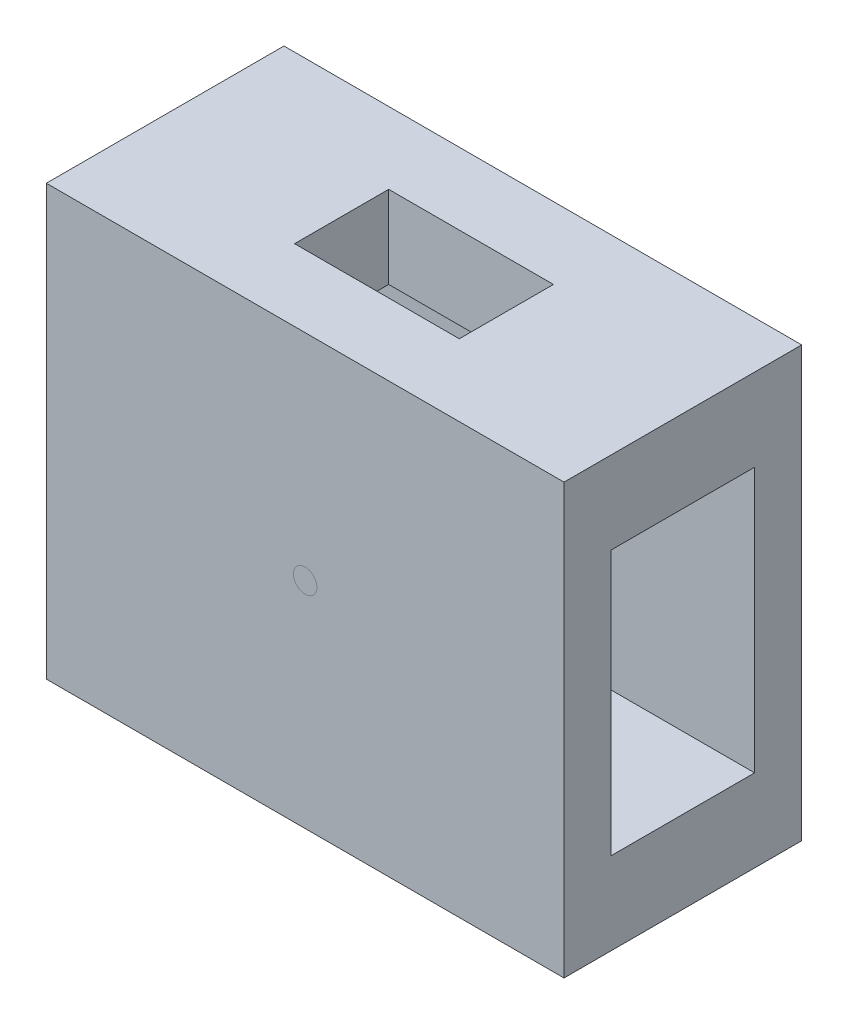
ISO-10303-21;
HEADER;
FILE_DESCRIPTION(('STEP AP214'),'2;1');
FILE_NAME('part.step','',(''),(''),'','','');
FILE_SCHEMA(('AUTOMOTIVE_DESIGN { 1 0 10303 214 1 1 1 1 }'));
ENDSEC;
DATA;
#1=APPLICATION_CONTEXT('core data for automotive mechanical design processes');
#2=APPLICATION_PROTOCOL_DEFINITION('international standard','automotive_design',2000,#1);
#3=PRODUCT_CONTEXT('',#1,'mechanical');
#4=PRODUCT('Part','Part','',(#3));
#5=PRODUCT_RELATED_PRODUCT_CATEGORY('part','',(#4));
#6=PRODUCT_DEFINITION_FORMATION('','',#4);
#7=PRODUCT_DEFINITION_CONTEXT('part definition',#1,'design');
#8=PRODUCT_DEFINITION('design','',#6,#7);
#9=PRODUCT_DEFINITION_SHAPE('','',#8);
#10=(LENGTH_UNIT() NAMED_UNIT(*) SI_UNIT(.MILLI.,.METRE.));
#11=(NAMED_UNIT(*) PLANE_ANGLE_UNIT() SI_UNIT($,.RADIAN.));
#12=(NAMED_UNIT(*) SI_UNIT($,.STERADIAN.) SOLID_ANGLE_UNIT());
#13=UNCERTAINTY_MEASURE_WITH_UNIT(LENGTH_MEASURE(1.E-05),#10,'distance_accuracy_value','');
#14=(GEOMETRIC_REPRESENTATION_CONTEXT(3) GLOBAL_UNCERTAINTY_ASSIGNED_CONTEXT((#13)) GLOBAL_UNIT_ASSIGNED_CONTEXT((#10,
#11,#12)) REPRESENTATION_CONTEXT('',''));
#15=CARTESIAN_POINT('',(0.,0.,0.));
#16=DIRECTION('',(0.,0.,1.));
#17=DIRECTION('',(1.,0.,0.));
#18=AXIS2_PLACEMENT_3D('',#15,#16,#17);
#19=CARTESIAN_POINT('',(22.,0.,0.));
#20=DIRECTION('',(-1.,0.,0.));
#21=DIRECTION('',(0.,0.,1.));
#22=AXIS2_PLACEMENT_3D('',#19,#20,#21);
#23=PLANE('',#22);
#24=DIRECTION('',(0.,1.,0.));
#25=VECTOR('',#24,1.);
#26=CARTESIAN_POINT('',(22.,-18.25,-10.1));
#27=LINE('',#26,#25);
#28=CARTESIAN_POINT('',(22.,-18.25,-10.1));
#29=VERTEX_POINT('',#28);
#30=CARTESIAN_POINT('',(22.,18.25,-10.1));
#31=VERTEX_POINT('',#30);
#32=EDGE_CURVE('E240',#29,#31,#27,.T.);
#33=ORIENTED_EDGE('',*,*,#32,.T.);
#34=DIRECTION('',(0.,0.,1.));
#35=VECTOR('',#34,1.);
#36=CARTESIAN_POINT('',(22.,18.25,10.1));
#37=LINE('',#36,#35);
#38=CARTESIAN_POINT('',(22.,18.25,10.1));
#39=VERTEX_POINT('',#38);
#40=EDGE_CURVE('E244',#31,#39,#37,.T.);
#41=ORIENTED_EDGE('',*,*,#40,.T.);
#42=DIRECTION('',(0.,-1.,0.));
#43=VECTOR('',#42,1.);
#44=CARTESIAN_POINT('',(22.,-18.25,10.1));
#45=LINE('',#44,#43);
#46=CARTESIAN_POINT('',(22.,-18.25,10.1));
#47=VERTEX_POINT('',#46);
#48=EDGE_CURVE('E248',#39,#47,#45,.T.);
#49=ORIENTED_EDGE('',*,*,#48,.T.);
#50=DIRECTION('',(0.,0.,-1.));
#51=VECTOR('',#50,1.);
#52=CARTESIAN_POINT('',(22.,-18.25,10.1));
#53=LINE('',#52,#51);
#54=EDGE_CURVE('E251',#47,#29,#53,.T.);
#55=ORIENTED_EDGE('',*,*,#54,.T.);
#56=EDGE_LOOP('',(#33,#41,#49,#55));
#57=FACE_BOUND('',#56,.T.);
#58=DIRECTION('',(0.,1.,0.));
#59=VECTOR('',#58,1.);
#60=CARTESIAN_POINT('',(22.,-11.25,-6.1));
#61=LINE('',#60,#59);
#62=CARTESIAN_POINT('',(22.,-11.25,-6.1));
#63=VERTEX_POINT('',#62);
#64=CARTESIAN_POINT('',(22.,11.25,-6.1));
#65=VERTEX_POINT('',#64);
#66=EDGE_CURVE('E197',#63,#65,#61,.T.);
#67=ORIENTED_EDGE('',*,*,#66,.F.);
#68=DIRECTION('',(0.,0.,-1.));
#69=VECTOR('',#68,1.);
#70=CARTESIAN_POINT('',(22.,-11.25,6.1));
#71=LINE('',#70,#69);
#72=CARTESIAN_POINT('',(22.,-11.25,6.1));
#73=VERTEX_POINT('',#72);
#74=EDGE_CURVE('E208',#73,#63,#71,.T.);
#75=ORIENTED_EDGE('',*,*,#74,.F.);
#76=DIRECTION('',(0.,-1.,0.));
#77=VECTOR('',#76,1.);
#78=CARTESIAN_POINT('',(22.,-11.25,6.1));
#79=LINE('',#78,#77);
#80=CARTESIAN_POINT('',(22.,11.25,6.1));
#81=VERTEX_POINT('',#80);
#82=EDGE_CURVE('E204',#81,#73,#79,.T.);
#83=ORIENTED_EDGE('',*,*,#82,.F.);
#84=DIRECTION('',(0.,0.,1.));
#85=VECTOR('',#84,1.);
#86=CARTESIAN_POINT('',(22.,11.25,6.1));
#87=LINE('',#86,#85);
#88=EDGE_CURVE('E200',#65,#81,#87,.T.);
#89=ORIENTED_EDGE('',*,*,#88,.F.);
#90=EDGE_LOOP('',(#67,#75,#83,#89));
#91=FACE_BOUND('',#90,.T.);
#92=ADVANCED_FACE('F39',(#57,#91),#23,.F.);
#93=CARTESIAN_POINT('',(-22.,0.,0.));
#94=DIRECTION('',(-1.,0.,0.));
#95=DIRECTION('',(0.,0.,1.));
#96=AXIS2_PLACEMENT_3D('',#93,#94,#95);
#97=PLANE('',#96);
#98=DIRECTION('',(0.,1.,0.));
#99=VECTOR('',#98,1.);
#100=CARTESIAN_POINT('',(-22.,-18.25,-10.1));
#101=LINE('',#100,#99);
#102=CARTESIAN_POINT('',(-22.,-18.25,-10.1));
#103=VERTEX_POINT('',#102);
#104=CARTESIAN_POINT('',(-22.,18.25,-10.1));
#105=VERTEX_POINT('',#104);
#106=EDGE_CURVE('E239',#103,#105,#101,.T.);
#107=ORIENTED_EDGE('',*,*,#106,.F.);
#108=DIRECTION('',(0.,0.,-1.));
#109=VECTOR('',#108,1.);
#110=CARTESIAN_POINT('',(-22.,-18.25,10.1));
#111=LINE('',#110,#109);
#112=CARTESIAN_POINT('',(-22.,-18.25,10.1));
#113=VERTEX_POINT('',#112);
#114=EDGE_CURVE('E245',#113,#103,#111,.T.);
#115=ORIENTED_EDGE('',*,*,#114,.F.);
#116=DIRECTION('',(0.,-1.,0.));
#117=VECTOR('',#116,1.);
#118=CARTESIAN_POINT('',(-22.,-18.25,10.1));
#119=LINE('',#118,#117);
#120=CARTESIAN_POINT('',(-22.,18.25,10.1));
#121=VERTEX_POINT('',#120);
#122=EDGE_CURVE('E261',#121,#113,#119,.T.);
#123=ORIENTED_EDGE('',*,*,#122,.F.);
#124=DIRECTION('',(0.,0.,1.));
#125=VECTOR('',#124,1.);
#126=CARTESIAN_POINT('',(-22.,18.25,10.1));
#127=LINE('',#126,#125);
#128=EDGE_CURVE('E258',#105,#121,#127,.T.);
#129=ORIENTED_EDGE('',*,*,#128,.F.);
#130=EDGE_LOOP('',(#107,#115,#123,#129));
#131=FACE_BOUND('',#130,.T.);
#132=DIRECTION('',(0.,0.,-1.));
#133=VECTOR('',#132,1.);
#134=CARTESIAN_POINT('',(-22.,-11.25,6.1));
#135=LINE('',#134,#133);
#136=CARTESIAN_POINT('',(-22.,-11.25,6.1));
#137=VERTEX_POINT('',#136);
#138=CARTESIAN_POINT('',(-22.,-11.25,-6.1));
#139=VERTEX_POINT('',#138);
#140=EDGE_CURVE('E201',#137,#139,#135,.T.);
#141=ORIENTED_EDGE('',*,*,#140,.T.);
#142=DIRECTION('',(0.,1.,0.));
#143=VECTOR('',#142,1.);
#144=CARTESIAN_POINT('',(-22.,-11.25,-6.1));
#145=LINE('',#144,#143);
#146=CARTESIAN_POINT('',(-22.,11.25,-6.1));
#147=VERTEX_POINT('',#146);
#148=EDGE_CURVE('E193',#139,#147,#145,.T.);
#149=ORIENTED_EDGE('',*,*,#148,.T.);
#150=DIRECTION('',(0.,0.,1.));
#151=VECTOR('',#150,1.);
#152=CARTESIAN_POINT('',(-22.,11.25,6.1));
#153=LINE('',#152,#151);
#154=CARTESIAN_POINT('',(-22.,11.25,6.1));
#155=VERTEX_POINT('',#154);
#156=EDGE_CURVE('E215',#147,#155,#153,.T.);
#157=ORIENTED_EDGE('',*,*,#156,.T.);
#158=DIRECTION('',(0.,-1.,0.));
#159=VECTOR('',#158,1.);
#160=CARTESIAN_POINT('',(-22.,-11.25,6.1));
#161=LINE('',#160,#159);
#162=EDGE_CURVE('E219',#155,#137,#161,.T.);
#163=ORIENTED_EDGE('',*,*,#162,.T.);
#164=EDGE_LOOP('',(#141,#149,#157,#163));
#165=FACE_BOUND('',#164,.T.);
#166=ADVANCED_FACE('F367',(#131,#165),#97,.T.);
#167=CARTESIAN_POINT('',(22.,-18.25,-10.1));
#168=DIRECTION('',(0.,0.,1.));
#169=DIRECTION('',(1.,0.,0.));
#170=AXIS2_PLACEMENT_3D('',#167,#168,#169);
#171=PLANE('',#170);
#172=ORIENTED_EDGE('',*,*,#106,.T.);
#173=DIRECTION('',(-1.,0.,0.));
#174=VECTOR('',#173,1.);
#175=CARTESIAN_POINT('',(22.,18.25,-10.1));
#176=LINE('',#175,#174);
#177=EDGE_CURVE('E277',#31,#105,#176,.T.);
#178=ORIENTED_EDGE('',*,*,#177,.F.);
#179=ORIENTED_EDGE('',*,*,#32,.F.);
#180=DIRECTION('',(-1.,0.,0.));
#181=VECTOR('',#180,1.);
#182=CARTESIAN_POINT('',(22.,-18.25,-10.1));
#183=LINE('',#182,#181);
#184=EDGE_CURVE('E254',#29,#103,#183,.T.);
#185=ORIENTED_EDGE('',*,*,#184,.T.);
#186=EDGE_LOOP('',(#172,#178,#179,#185));
#187=FACE_BOUND('',#186,.T.);
#188=ADVANCED_FACE('F41',(#187),#171,.F.);
#189=CARTESIAN_POINT('',(22.,18.25,10.1));
#190=DIRECTION('',(0.,-1.,0.));
#191=DIRECTION('',(0.,0.,-1.));
#192=AXIS2_PLACEMENT_3D('',#189,#190,#191);
#193=PLANE('',#192);
#194=DIRECTION('',(1.,0.,0.));
#195=VECTOR('',#194,1.);
#196=CARTESIAN_POINT('',(22.,18.25,-4.));
#197=LINE('',#196,#195);
#198=CARTESIAN_POINT('',(-7.,18.25,-4.));
#199=VERTEX_POINT('',#198);
#200=CARTESIAN_POINT('',(7.,18.25,-4.));
#201=VERTEX_POINT('',#200);
#202=EDGE_CURVE('E159',#199,#201,#197,.T.);
#203=ORIENTED_EDGE('',*,*,#202,.T.);
#204=DIRECTION('',(0.,0.,1.));
#205=VECTOR('',#204,1.);
#206=CARTESIAN_POINT('',(7.,18.25,10.1));
#207=LINE('',#206,#205);
#208=CARTESIAN_POINT('',(7.,18.25,4.));
#209=VERTEX_POINT('',#208);
#210=EDGE_CURVE('E177',#201,#209,#207,.T.);
#211=ORIENTED_EDGE('',*,*,#210,.T.);
#212=DIRECTION('',(-1.,0.,0.));
#213=VECTOR('',#212,1.);
#214=CARTESIAN_POINT('',(22.,18.25,4.));
#215=LINE('',#214,#213);
#216=CARTESIAN_POINT('',(-7.,18.25,4.));
#217=VERTEX_POINT('',#216);
#218=EDGE_CURVE('E185',#209,#217,#215,.T.);
#219=ORIENTED_EDGE('',*,*,#218,.T.);
#220=DIRECTION('',(0.,0.,-1.));
#221=VECTOR('',#220,1.);
#222=CARTESIAN_POINT('',(-7.,18.25,10.1));
#223=LINE('',#222,#221);
#224=EDGE_CURVE('E325',#217,#199,#223,.T.);
#225=ORIENTED_EDGE('',*,*,#224,.T.);
#226=EDGE_LOOP('',(#203,#211,#219,#225));
#227=FACE_BOUND('',#226,.T.);
#228=ORIENTED_EDGE('',*,*,#128,.T.);
#229=DIRECTION('',(-1.,0.,0.));
#230=VECTOR('',#229,1.);
#231=CARTESIAN_POINT('',(22.,18.25,10.1));
#232=LINE('',#231,#230);
#233=EDGE_CURVE('E273',#39,#121,#232,.T.);
#234=ORIENTED_EDGE('',*,*,#233,.F.);
#235=ORIENTED_EDGE('',*,*,#40,.F.);
#236=ORIENTED_EDGE('',*,*,#177,.T.);
#237=EDGE_LOOP('',(#228,#234,#235,#236));
#238=FACE_BOUND('',#237,.T.);
#239=ADVANCED_FACE('F336',(#227,#238),#193,.F.);
#240=CARTESIAN_POINT('',(22.,-18.25,10.1));
#241=DIRECTION('',(0.,0.,-1.));
#242=DIRECTION('',(-1.,0.,0.));
#243=AXIS2_PLACEMENT_3D('',#240,#241,#242);
#244=PLANE('',#243);
#245=CARTESIAN_POINT('',(0.,0.,10.1));
#246=DIRECTION('',(0.,0.,1.));
#247=DIRECTION('',(1.,0.,0.));
#248=AXIS2_PLACEMENT_3D('',#245,#246,#247);
#249=CIRCLE('',#248,1.);
#250=CARTESIAN_POINT('',(1.,0.,10.1));
#251=VERTEX_POINT('',#250);
#252=EDGE_CURVE('E183',#251,#251,#249,.T.);
#253=ORIENTED_EDGE('',*,*,#252,.F.);
#254=EDGE_LOOP('',(#253));
#255=FACE_BOUND('',#254,.T.);
#256=ORIENTED_EDGE('',*,*,#122,.T.);
#257=DIRECTION('',(-1.,0.,0.));
#258=VECTOR('',#257,1.);
#259=CARTESIAN_POINT('',(22.,-18.25,10.1));
#260=LINE('',#259,#258);
#261=EDGE_CURVE('E269',#47,#113,#260,.T.);
#262=ORIENTED_EDGE('',*,*,#261,.F.);
#263=ORIENTED_EDGE('',*,*,#48,.F.);
#264=ORIENTED_EDGE('',*,*,#233,.T.);
#265=EDGE_LOOP('',(#256,#262,#263,#264));
#266=FACE_BOUND('',#265,.T.);
#267=ADVANCED_FACE('F382',(#255,#266),#244,.F.);
#268=CARTESIAN_POINT('',(22.,-18.25,10.1));
#269=DIRECTION('',(0.,1.,0.));
#270=DIRECTION('',(0.,0.,1.));
#271=AXIS2_PLACEMENT_3D('',#268,#269,#270);
#272=PLANE('',#271);
#273=DIRECTION('',(1.,0.,0.));
#274=VECTOR('',#273,1.);
#275=CARTESIAN_POINT('',(22.,-18.25,4.));
#276=LINE('',#275,#274);
#277=CARTESIAN_POINT('',(-7.,-18.25,4.));
#278=VERTEX_POINT('',#277);
#279=CARTESIAN_POINT('',(7.,-18.25,4.));
#280=VERTEX_POINT('',#279);
#281=EDGE_CURVE('E175',#278,#280,#276,.T.);
#282=ORIENTED_EDGE('',*,*,#281,.T.);
#283=DIRECTION('',(0.,0.,-1.));
#284=VECTOR('',#283,1.);
#285=CARTESIAN_POINT('',(7.,-18.25,10.1));
#286=LINE('',#285,#284);
#287=CARTESIAN_POINT('',(7.,-18.25,-4.));
#288=VERTEX_POINT('',#287);
#289=EDGE_CURVE('E165',#280,#288,#286,.T.);
#290=ORIENTED_EDGE('',*,*,#289,.T.);
#291=DIRECTION('',(-1.,0.,0.));
#292=VECTOR('',#291,1.);
#293=CARTESIAN_POINT('',(22.,-18.25,-4.));
#294=LINE('',#293,#292);
#295=CARTESIAN_POINT('',(-7.,-18.25,-4.));
#296=VERTEX_POINT('',#295);
#297=EDGE_CURVE('E151',#288,#296,#294,.T.);
#298=ORIENTED_EDGE('',*,*,#297,.T.);
#299=DIRECTION('',(0.,0.,1.));
#300=VECTOR('',#299,1.);
#301=CARTESIAN_POINT('',(-7.,-18.25,10.1));
#302=LINE('',#301,#300);
#303=EDGE_CURVE('E303',#296,#278,#302,.T.);
#304=ORIENTED_EDGE('',*,*,#303,.T.);
#305=EDGE_LOOP('',(#282,#290,#298,#304));
#306=FACE_BOUND('',#305,.T.);
#307=ORIENTED_EDGE('',*,*,#114,.T.);
#308=ORIENTED_EDGE('',*,*,#184,.F.);
#309=ORIENTED_EDGE('',*,*,#54,.F.);
#310=ORIENTED_EDGE('',*,*,#261,.T.);
#311=EDGE_LOOP('',(#307,#308,#309,#310));
#312=FACE_BOUND('',#311,.T.);
#313=ADVANCED_FACE('F173',(#306,#312),#272,.F.);
#314=CARTESIAN_POINT('',(22.,-11.25,-6.1));
#315=DIRECTION('',(0.,0.,1.));
#316=DIRECTION('',(1.,0.,0.));
#317=AXIS2_PLACEMENT_3D('',#314,#315,#316);
#318=PLANE('',#317);
#319=ORIENTED_EDGE('',*,*,#148,.F.);
#320=DIRECTION('',(-1.,0.,0.));
#321=VECTOR('',#320,1.);
#322=CARTESIAN_POINT('',(22.,-11.25,-6.1));
#323=LINE('',#322,#321);
#324=EDGE_CURVE('E211',#63,#139,#323,.T.);
#325=ORIENTED_EDGE('',*,*,#324,.F.);
#326=ORIENTED_EDGE('',*,*,#66,.T.);
#327=DIRECTION('',(-1.,0.,0.));
#328=VECTOR('',#327,1.);
#329=CARTESIAN_POINT('',(22.,11.25,-6.1));
#330=LINE('',#329,#328);
#331=EDGE_CURVE('E235',#65,#147,#330,.T.);
#332=ORIENTED_EDGE('',*,*,#331,.T.);
#333=EDGE_LOOP('',(#319,#325,#326,#332));
#334=FACE_BOUND('',#333,.T.);
#335=ADVANCED_FACE('F377',(#334),#318,.T.);
#336=CARTESIAN_POINT('',(22.,11.25,6.1));
#337=DIRECTION('',(0.,-1.,0.));
#338=DIRECTION('',(0.,0.,-1.));
#339=AXIS2_PLACEMENT_3D('',#336,#337,#338);
#340=PLANE('',#339);
#341=DIRECTION('',(0.,0.,1.));
#342=VECTOR('',#341,1.);
#343=CARTESIAN_POINT('',(7.,11.25,6.1));
#344=LINE('',#343,#342);
#345=CARTESIAN_POINT('',(7.,11.25,-4.));
#346=VERTEX_POINT('',#345);
#347=CARTESIAN_POINT('',(7.,11.25,4.));
#348=VERTEX_POINT('',#347);
#349=EDGE_CURVE('E178',#346,#348,#344,.T.);
#350=ORIENTED_EDGE('',*,*,#349,.F.);
#351=DIRECTION('',(1.,0.,0.));
#352=VECTOR('',#351,1.);
#353=CARTESIAN_POINT('',(22.,11.25,-4.));
#354=LINE('',#353,#352);
#355=CARTESIAN_POINT('',(-7.,11.25,-4.));
#356=VERTEX_POINT('',#355);
#357=EDGE_CURVE('E160',#356,#346,#354,.T.);
#358=ORIENTED_EDGE('',*,*,#357,.F.);
#359=DIRECTION('',(0.,0.,-1.));
#360=VECTOR('',#359,1.);
#361=CARTESIAN_POINT('',(-7.,11.25,6.1));
#362=LINE('',#361,#360);
#363=CARTESIAN_POINT('',(-7.,11.25,4.));
#364=VERTEX_POINT('',#363);
#365=EDGE_CURVE('E319',#364,#356,#362,.T.);
#366=ORIENTED_EDGE('',*,*,#365,.F.);
#367=DIRECTION('',(-1.,0.,0.));
#368=VECTOR('',#367,1.);
#369=CARTESIAN_POINT('',(22.,11.25,4.));
#370=LINE('',#369,#368);
#371=EDGE_CURVE('E329',#348,#364,#370,.T.);
#372=ORIENTED_EDGE('',*,*,#371,.F.);
#373=EDGE_LOOP('',(#350,#358,#366,#372));
#374=FACE_BOUND('',#373,.T.);
#375=ORIENTED_EDGE('',*,*,#156,.F.);
#376=ORIENTED_EDGE('',*,*,#331,.F.);
#377=ORIENTED_EDGE('',*,*,#88,.T.);
#378=DIRECTION('',(-1.,0.,0.));
#379=VECTOR('',#378,1.);
#380=CARTESIAN_POINT('',(22.,11.25,6.1));
#381=LINE('',#380,#379);
#382=EDGE_CURVE('E232',#81,#155,#381,.T.);
#383=ORIENTED_EDGE('',*,*,#382,.T.);
#384=EDGE_LOOP('',(#375,#376,#377,#383));
#385=FACE_BOUND('',#384,.T.);
#386=ADVANCED_FACE('F351',(#374,#385),#340,.T.);
#387=CARTESIAN_POINT('',(22.,-11.25,6.1));
#388=DIRECTION('',(0.,0.,-1.));
#389=DIRECTION('',(-1.,0.,0.));
#390=AXIS2_PLACEMENT_3D('',#387,#388,#389);
#391=PLANE('',#390);
#392=ORIENTED_EDGE('',*,*,#162,.F.);
#393=ORIENTED_EDGE('',*,*,#382,.F.);
#394=ORIENTED_EDGE('',*,*,#82,.T.);
#395=DIRECTION('',(-1.,0.,0.));
#396=VECTOR('',#395,1.);
#397=CARTESIAN_POINT('',(22.,-11.25,6.1));
#398=LINE('',#397,#396);
#399=EDGE_CURVE('E229',#73,#137,#398,.T.);
#400=ORIENTED_EDGE('',*,*,#399,.T.);
#401=EDGE_LOOP('',(#392,#393,#394,#400));
#402=FACE_BOUND('',#401,.T.);
#403=ADVANCED_FACE('F415',(#402),#391,.T.);
#404=CARTESIAN_POINT('',(22.,-11.25,6.1));
#405=DIRECTION('',(0.,1.,0.));
#406=DIRECTION('',(0.,0.,1.));
#407=AXIS2_PLACEMENT_3D('',#404,#405,#406);
#408=PLANE('',#407);
#409=DIRECTION('',(0.,0.,-1.));
#410=VECTOR('',#409,1.);
#411=CARTESIAN_POINT('',(7.,-11.25,6.1));
#412=LINE('',#411,#410);
#413=CARTESIAN_POINT('',(7.,-11.25,4.));
#414=VERTEX_POINT('',#413);
#415=CARTESIAN_POINT('',(7.,-11.25,-4.));
#416=VERTEX_POINT('',#415);
#417=EDGE_CURVE('E11',#414,#416,#412,.T.);
#418=ORIENTED_EDGE('',*,*,#417,.F.);
#419=DIRECTION('',(1.,0.,0.));
#420=VECTOR('',#419,1.);
#421=CARTESIAN_POINT('',(22.,-11.25,4.));
#422=LINE('',#421,#420);
#423=CARTESIAN_POINT('',(-7.,-11.25,4.));
#424=VERTEX_POINT('',#423);
#425=EDGE_CURVE('E48',#424,#414,#422,.T.);
#426=ORIENTED_EDGE('',*,*,#425,.F.);
#427=DIRECTION('',(0.,0.,1.));
#428=VECTOR('',#427,1.);
#429=CARTESIAN_POINT('',(-7.,-11.25,6.1));
#430=LINE('',#429,#428);
#431=CARTESIAN_POINT('',(-7.,-11.25,-4.));
#432=VERTEX_POINT('',#431);
#433=EDGE_CURVE('E284',#432,#424,#430,.T.);
#434=ORIENTED_EDGE('',*,*,#433,.F.);
#435=DIRECTION('',(-1.,0.,0.));
#436=VECTOR('',#435,1.);
#437=CARTESIAN_POINT('',(22.,-11.25,-4.));
#438=LINE('',#437,#436);
#439=EDGE_CURVE('E281',#416,#432,#438,.T.);
#440=ORIENTED_EDGE('',*,*,#439,.F.);
#441=EDGE_LOOP('',(#418,#426,#434,#440));
#442=FACE_BOUND('',#441,.T.);
#443=ORIENTED_EDGE('',*,*,#140,.F.);
#444=ORIENTED_EDGE('',*,*,#399,.F.);
#445=ORIENTED_EDGE('',*,*,#74,.T.);
#446=ORIENTED_EDGE('',*,*,#324,.T.);
#447=EDGE_LOOP('',(#443,#444,#445,#446));
#448=FACE_BOUND('',#447,.T.);
#449=ADVANCED_FACE('F299',(#442,#448),#408,.T.);
#450=CARTESIAN_POINT('',(0.,0.,10.0999));
#451=DIRECTION('',(0.,0.,1.));
#452=DIRECTION('',(1.,0.,0.));
#453=AXIS2_PLACEMENT_3D('',#450,#451,#452);
#454=CYLINDRICAL_SURFACE('',#453,1.);
#455=CARTESIAN_POINT('',(0.,0.,10.0999));
#456=DIRECTION('',(0.,0.,1.));
#457=DIRECTION('',(1.,0.,0.));
#458=AXIS2_PLACEMENT_3D('',#455,#456,#457);
#459=CIRCLE('',#458,1.);
#460=CARTESIAN_POINT('',(1.,0.,10.0999));
#461=VERTEX_POINT('',#460);
#462=EDGE_CURVE('E189',#461,#461,#459,.T.);
#463=ORIENTED_EDGE('',*,*,#462,.F.);
#464=EDGE_LOOP('',(#463));
#465=FACE_BOUND('',#464,.T.);
#466=ORIENTED_EDGE('',*,*,#252,.T.);
#467=EDGE_LOOP('',(#466));
#468=FACE_BOUND('',#467,.T.);
#469=ADVANCED_FACE('F422',(#465,#468),#454,.F.);
#470=CARTESIAN_POINT('',(0.,0.,10.0999));
#471=DIRECTION('',(0.,0.,1.));
#472=DIRECTION('',(1.,0.,0.));
#473=AXIS2_PLACEMENT_3D('',#470,#471,#472);
#474=PLANE('',#473);
#475=ORIENTED_EDGE('',*,*,#462,.T.);
#476=EDGE_LOOP('',(#475));
#477=FACE_BOUND('',#476,.T.);
#478=ADVANCED_FACE('F365',(#477),#474,.T.);
#479=CARTESIAN_POINT('',(-7.,-25.,-4.));
#480=DIRECTION('',(0.,0.,-1.));
#481=DIRECTION('',(-1.,0.,0.));
#482=AXIS2_PLACEMENT_3D('',#479,#480,#481);
#483=PLANE('',#482);
#484=DIRECTION('',(0.,1.,0.));
#485=VECTOR('',#484,1.);
#486=CARTESIAN_POINT('',(7.,-25.,-4.));
#487=LINE('',#486,#485);
#488=EDGE_CURVE('E154',#288,#416,#487,.T.);
#489=ORIENTED_EDGE('',*,*,#488,.T.);
#490=ORIENTED_EDGE('',*,*,#439,.T.);
#491=DIRECTION('',(0.,1.,0.));
#492=VECTOR('',#491,1.);
#493=CARTESIAN_POINT('',(-7.,-25.,-4.));
#494=LINE('',#493,#492);
#495=EDGE_CURVE('E63',#296,#432,#494,.T.);
#496=ORIENTED_EDGE('',*,*,#495,.F.);
#497=ORIENTED_EDGE('',*,*,#297,.F.);
#498=EDGE_LOOP('',(#489,#490,#496,#497));
#499=FACE_BOUND('',#498,.T.);
#500=ADVANCED_FACE('F153',(#499),#483,.F.);
#501=CARTESIAN_POINT('',(-7.,-25.,4.));
#502=DIRECTION('',(-1.,0.,0.));
#503=DIRECTION('',(0.,0.,1.));
#504=AXIS2_PLACEMENT_3D('',#501,#502,#503);
#505=PLANE('',#504);
#506=ORIENTED_EDGE('',*,*,#495,.T.);
#507=ORIENTED_EDGE('',*,*,#433,.T.);
#508=DIRECTION('',(0.,1.,0.));
#509=VECTOR('',#508,1.);
#510=CARTESIAN_POINT('',(-7.,-25.,4.));
#511=LINE('',#510,#509);
#512=EDGE_CURVE('E293',#278,#424,#511,.T.);
#513=ORIENTED_EDGE('',*,*,#512,.F.);
#514=ORIENTED_EDGE('',*,*,#303,.F.);
#515=EDGE_LOOP('',(#506,#507,#513,#514));
#516=FACE_BOUND('',#515,.T.);
#517=ADVANCED_FACE('F302',(#516),#505,.F.);
#518=CARTESIAN_POINT('',(-7.,-25.,4.));
#519=DIRECTION('',(0.,0.,1.));
#520=DIRECTION('',(1.,0.,0.));
#521=AXIS2_PLACEMENT_3D('',#518,#519,#520);
#522=PLANE('',#521);
#523=ORIENTED_EDGE('',*,*,#512,.T.);
#524=ORIENTED_EDGE('',*,*,#425,.T.);
#525=DIRECTION('',(0.,1.,0.));
#526=VECTOR('',#525,1.);
#527=CARTESIAN_POINT('',(7.,-25.,4.));
#528=LINE('',#527,#526);
#529=EDGE_CURVE('E291',#280,#414,#528,.T.);
#530=ORIENTED_EDGE('',*,*,#529,.F.);
#531=ORIENTED_EDGE('',*,*,#281,.F.);
#532=EDGE_LOOP('',(#523,#524,#530,#531));
#533=FACE_BOUND('',#532,.T.);
#534=ADVANCED_FACE('F290',(#533),#522,.F.);
#535=CARTESIAN_POINT('',(7.,-25.,4.));
#536=DIRECTION('',(1.,0.,0.));
#537=DIRECTION('',(0.,0.,-1.));
#538=AXIS2_PLACEMENT_3D('',#535,#536,#537);
#539=PLANE('',#538);
#540=ORIENTED_EDGE('',*,*,#529,.T.);
#541=ORIENTED_EDGE('',*,*,#417,.T.);
#542=ORIENTED_EDGE('',*,*,#488,.F.);
#543=ORIENTED_EDGE('',*,*,#289,.F.);
#544=EDGE_LOOP('',(#540,#541,#542,#543));
#545=FACE_BOUND('',#544,.T.);
#546=ADVANCED_FACE('F164',(#545),#539,.F.);
#547=EDGE_CURVE('E55',#346,#201,#487,.T.);
#548=ORIENTED_EDGE('',*,*,#547,.F.);
#549=ORIENTED_EDGE('',*,*,#349,.T.);
#550=EDGE_CURVE('E297',#348,#209,#528,.T.);
#551=ORIENTED_EDGE('',*,*,#550,.T.);
#552=ORIENTED_EDGE('',*,*,#210,.F.);
#553=EDGE_LOOP('',(#548,#549,#551,#552));
#554=FACE_BOUND('',#553,.T.);
#555=ADVANCED_FACE('F345',(#554),#539,.F.);
#556=ORIENTED_EDGE('',*,*,#550,.F.);
#557=ORIENTED_EDGE('',*,*,#371,.T.);
#558=EDGE_CURVE('E305',#364,#217,#511,.T.);
#559=ORIENTED_EDGE('',*,*,#558,.T.);
#560=ORIENTED_EDGE('',*,*,#218,.F.);
#561=EDGE_LOOP('',(#556,#557,#559,#560));
#562=FACE_BOUND('',#561,.T.);
#563=ADVANCED_FACE('F341',(#562),#522,.F.);
#564=ORIENTED_EDGE('',*,*,#558,.F.);
#565=ORIENTED_EDGE('',*,*,#365,.T.);
#566=EDGE_CURVE('E170',#356,#199,#494,.T.);
#567=ORIENTED_EDGE('',*,*,#566,.T.);
#568=ORIENTED_EDGE('',*,*,#224,.F.);
#569=EDGE_LOOP('',(#564,#565,#567,#568));
#570=FACE_BOUND('',#569,.T.);
#571=ADVANCED_FACE('F355',(#570),#505,.F.);
#572=ORIENTED_EDGE('',*,*,#566,.F.);
#573=ORIENTED_EDGE('',*,*,#357,.T.);
#574=ORIENTED_EDGE('',*,*,#547,.T.);
#575=ORIENTED_EDGE('',*,*,#202,.F.);
#576=EDGE_LOOP('',(#572,#573,#574,#575));
#577=FACE_BOUND('',#576,.T.);
#578=ADVANCED_FACE('F356',(#577),#483,.F.);
#579=CLOSED_SHELL('',(#92,#166,#188,#239,#267,#313,#335,#386,#403,#449,#469,#478,#500,#517,#534,
#546,#555,#563,#571,#578));
#580=MANIFOLD_SOLID_BREP('B2',#579);
#581=ADVANCED_BREP_SHAPE_REPRESENTATION('',(#18,#580),#14);
#582=SHAPE_DEFINITION_REPRESENTATION(#9,#581);
ENDSEC;
END-ISO-10303-21;
